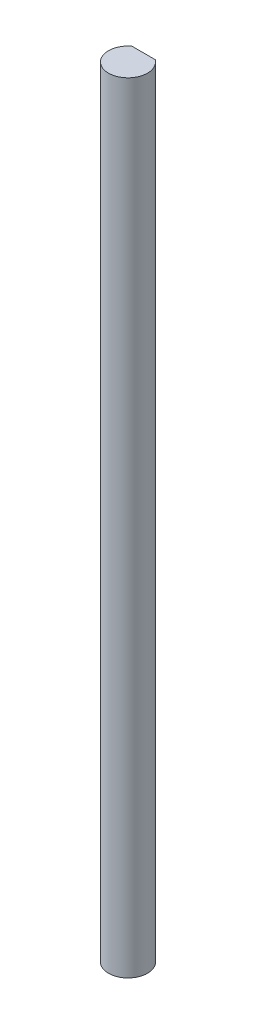
ISO-10303-21;
HEADER;
FILE_DESCRIPTION(('STEP AP214'),'2;1');
FILE_NAME('part.step','',(''),(''),'','','');
FILE_SCHEMA(('AUTOMOTIVE_DESIGN { 1 0 10303 214 1 1 1 1 }'));
ENDSEC;
DATA;
#1=APPLICATION_CONTEXT('core data for automotive mechanical design processes');
#2=APPLICATION_PROTOCOL_DEFINITION('international standard','automotive_design',2000,#1);
#3=PRODUCT_CONTEXT('',#1,'mechanical');
#4=PRODUCT('Part','Part','',(#3));
#5=PRODUCT_RELATED_PRODUCT_CATEGORY('part','',(#4));
#6=PRODUCT_DEFINITION_FORMATION('','',#4);
#7=PRODUCT_DEFINITION_CONTEXT('part definition',#1,'design');
#8=PRODUCT_DEFINITION('design','',#6,#7);
#9=PRODUCT_DEFINITION_SHAPE('','',#8);
#10=(LENGTH_UNIT() NAMED_UNIT(*) SI_UNIT(.MILLI.,.METRE.));
#11=(NAMED_UNIT(*) PLANE_ANGLE_UNIT() SI_UNIT($,.RADIAN.));
#12=(NAMED_UNIT(*) SI_UNIT($,.STERADIAN.) SOLID_ANGLE_UNIT());
#13=UNCERTAINTY_MEASURE_WITH_UNIT(LENGTH_MEASURE(1.E-05),#10,'distance_accuracy_value','');
#14=(GEOMETRIC_REPRESENTATION_CONTEXT(3) GLOBAL_UNCERTAINTY_ASSIGNED_CONTEXT((#13)) GLOBAL_UNIT_ASSIGNED_CONTEXT((#10,
#11,#12)) REPRESENTATION_CONTEXT('',''));
#15=CARTESIAN_POINT('',(0.,0.,0.));
#16=DIRECTION('',(0.,0.,1.));
#17=DIRECTION('',(1.,0.,0.));
#18=AXIS2_PLACEMENT_3D('',#15,#16,#17);
#19=CARTESIAN_POINT('',(0.,127.,0.));
#20=DIRECTION('',(0.,-1.,0.));
#21=DIRECTION('',(0.,0.,-1.));
#22=AXIS2_PLACEMENT_3D('',#19,#20,#21);
#23=CYLINDRICAL_SURFACE('',#22,3.175);
#24=CARTESIAN_POINT('',(0.,0.,0.));
#25=DIRECTION('',(0.,1.,0.));
#26=DIRECTION('',(0.,0.,1.));
#27=AXIS2_PLACEMENT_3D('',#24,#25,#26);
#28=CIRCLE('',#27,3.175);
#29=CARTESIAN_POINT('',(-1.905,0.,-2.54));
#30=VERTEX_POINT('',#29);
#31=CARTESIAN_POINT('',(1.905,0.,-2.54));
#32=VERTEX_POINT('',#31);
#33=EDGE_CURVE('E66',#30,#32,#28,.T.);
#34=ORIENTED_EDGE('',*,*,#33,.T.);
#35=DIRECTION('',(0.,-1.,0.));
#36=VECTOR('',#35,1.);
#37=CARTESIAN_POINT('',(1.905,127.,-2.54));
#38=LINE('',#37,#36);
#39=CARTESIAN_POINT('',(1.905,127.,-2.54));
#40=VERTEX_POINT('',#39);
#41=EDGE_CURVE('E11',#40,#32,#38,.T.);
#42=ORIENTED_EDGE('',*,*,#41,.F.);
#43=CARTESIAN_POINT('',(0.,127.,0.));
#44=DIRECTION('',(0.,1.,0.));
#45=DIRECTION('',(0.,0.,1.));
#46=AXIS2_PLACEMENT_3D('',#43,#44,#45);
#47=CIRCLE('',#46,3.175);
#48=CARTESIAN_POINT('',(-1.905,127.,-2.54));
#49=VERTEX_POINT('',#48);
#50=EDGE_CURVE('E65',#49,#40,#47,.T.);
#51=ORIENTED_EDGE('',*,*,#50,.F.);
#52=DIRECTION('',(0.,-1.,0.));
#53=VECTOR('',#52,1.);
#54=CARTESIAN_POINT('',(-1.905,127.,-2.54));
#55=LINE('',#54,#53);
#56=EDGE_CURVE('E43',#49,#30,#55,.T.);
#57=ORIENTED_EDGE('',*,*,#56,.T.);
#58=EDGE_LOOP('',(#34,#42,#51,#57));
#59=FACE_BOUND('',#58,.T.);
#60=ADVANCED_FACE('F35',(#59),#23,.T.);
#61=CARTESIAN_POINT('',(-1.905,127.,-2.54));
#62=DIRECTION('',(0.,0.,1.));
#63=DIRECTION('',(1.,0.,0.));
#64=AXIS2_PLACEMENT_3D('',#61,#62,#63);
#65=PLANE('',#64);
#66=DIRECTION('',(-1.,0.,0.));
#67=VECTOR('',#66,1.);
#68=CARTESIAN_POINT('',(-1.905,0.,-2.54));
#69=LINE('',#68,#67);
#70=EDGE_CURVE('E58',#32,#30,#69,.T.);
#71=ORIENTED_EDGE('',*,*,#70,.T.);
#72=ORIENTED_EDGE('',*,*,#56,.F.);
#73=DIRECTION('',(-1.,0.,0.));
#74=VECTOR('',#73,1.);
#75=CARTESIAN_POINT('',(-1.905,127.,-2.54));
#76=LINE('',#75,#74);
#77=EDGE_CURVE('E50',#40,#49,#76,.T.);
#78=ORIENTED_EDGE('',*,*,#77,.F.);
#79=ORIENTED_EDGE('',*,*,#41,.T.);
#80=EDGE_LOOP('',(#71,#72,#78,#79));
#81=FACE_BOUND('',#80,.T.);
#82=ADVANCED_FACE('F61',(#81),#65,.F.);
#83=CARTESIAN_POINT('',(0.,127.,0.));
#84=DIRECTION('',(0.,1.,0.));
#85=DIRECTION('',(0.,0.,1.));
#86=AXIS2_PLACEMENT_3D('',#83,#84,#85);
#87=PLANE('',#86);
#88=ORIENTED_EDGE('',*,*,#50,.T.);
#89=ORIENTED_EDGE('',*,*,#77,.T.);
#90=EDGE_LOOP('',(#88,#89));
#91=FACE_BOUND('',#90,.T.);
#92=ADVANCED_FACE('F73',(#91),#87,.T.);
#93=CARTESIAN_POINT('',(0.,0.,0.));
#94=DIRECTION('',(0.,1.,0.));
#95=DIRECTION('',(0.,0.,1.));
#96=AXIS2_PLACEMENT_3D('',#93,#94,#95);
#97=PLANE('',#96);
#98=ORIENTED_EDGE('',*,*,#33,.F.);
#99=ORIENTED_EDGE('',*,*,#70,.F.);
#100=EDGE_LOOP('',(#98,#99));
#101=FACE_BOUND('',#100,.T.);
#102=ADVANCED_FACE('F69',(#101),#97,.F.);
#103=CLOSED_SHELL('',(#60,#82,#92,#102));
#104=MANIFOLD_SOLID_BREP('B2',#103);
#105=ADVANCED_BREP_SHAPE_REPRESENTATION('',(#18,#104),#14);
#106=SHAPE_DEFINITION_REPRESENTATION(#9,#105);
ENDSEC;
END-ISO-10303-21;
